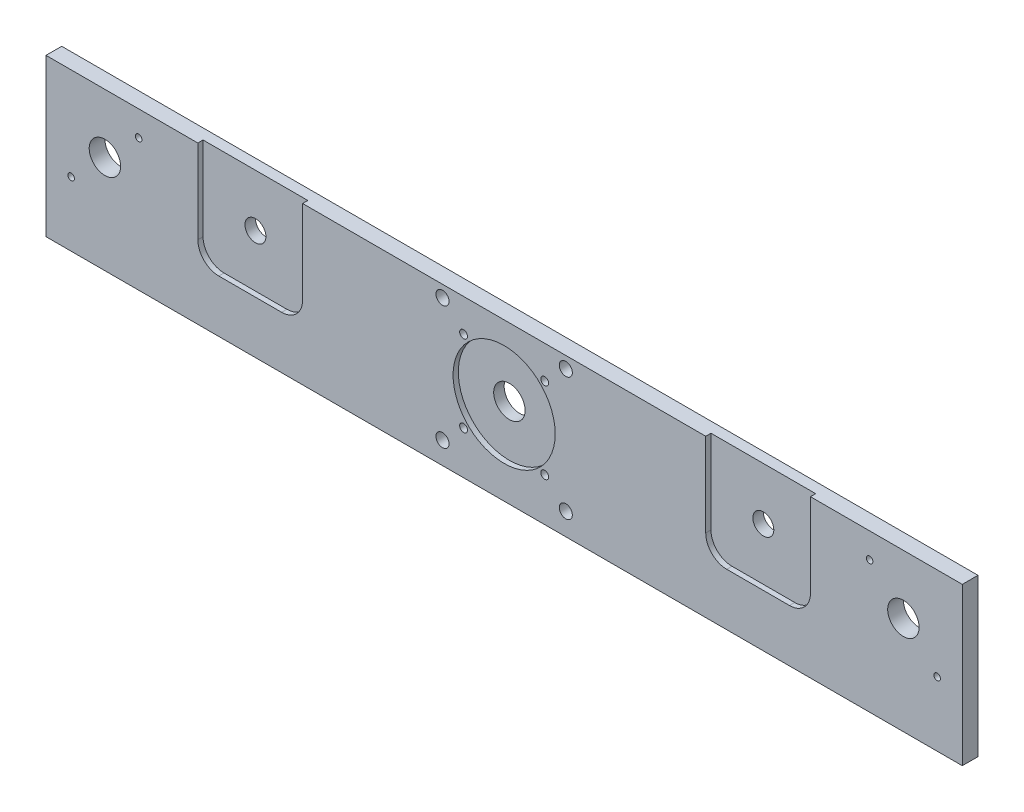
ISO-10303-21;
HEADER;
FILE_DESCRIPTION(('STEP AP214'),'2;1');
FILE_NAME('part.step','',(''),(''),'','','');
FILE_SCHEMA(('AUTOMOTIVE_DESIGN { 1 0 10303 214 1 1 1 1 }'));
ENDSEC;
DATA;
#1=APPLICATION_CONTEXT('core data for automotive mechanical design processes');
#2=APPLICATION_PROTOCOL_DEFINITION('international standard','automotive_design',2000,#1);
#3=PRODUCT_CONTEXT('',#1,'mechanical');
#4=PRODUCT('Part','Part','',(#3));
#5=PRODUCT_RELATED_PRODUCT_CATEGORY('part','',(#4));
#6=PRODUCT_DEFINITION_FORMATION('','',#4);
#7=PRODUCT_DEFINITION_CONTEXT('part definition',#1,'design');
#8=PRODUCT_DEFINITION('design','',#6,#7);
#9=PRODUCT_DEFINITION_SHAPE('','',#8);
#10=(LENGTH_UNIT() NAMED_UNIT(*) SI_UNIT(.MILLI.,.METRE.));
#11=(NAMED_UNIT(*) PLANE_ANGLE_UNIT() SI_UNIT($,.RADIAN.));
#12=(NAMED_UNIT(*) SI_UNIT($,.STERADIAN.) SOLID_ANGLE_UNIT());
#13=UNCERTAINTY_MEASURE_WITH_UNIT(LENGTH_MEASURE(1.E-05),#10,'distance_accuracy_value','');
#14=(GEOMETRIC_REPRESENTATION_CONTEXT(3) GLOBAL_UNCERTAINTY_ASSIGNED_CONTEXT((#13)) GLOBAL_UNIT_ASSIGNED_CONTEXT((#10,
#11,#12)) REPRESENTATION_CONTEXT('',''));
#15=CARTESIAN_POINT('',(0.,0.,0.));
#16=DIRECTION('',(0.,0.,1.));
#17=DIRECTION('',(1.,0.,0.));
#18=AXIS2_PLACEMENT_3D('',#15,#16,#17);
#19=CARTESIAN_POINT('',(-175.,-28.,0.));
#20=DIRECTION('',(0.,0.,1.));
#21=DIRECTION('',(1.,0.,0.));
#22=AXIS2_PLACEMENT_3D('',#19,#20,#21);
#23=CYLINDRICAL_SURFACE('',#22,6.00000000000002);
#24=CARTESIAN_POINT('',(-175.,-28.,0.));
#25=DIRECTION('',(0.,0.,1.));
#26=DIRECTION('',(1.,0.,0.));
#27=AXIS2_PLACEMENT_3D('',#24,#25,#26);
#28=CIRCLE('',#27,6.00000000000002);
#29=CARTESIAN_POINT('',(-169.,-28.,0.));
#30=VERTEX_POINT('',#29);
#31=EDGE_CURVE('E272',#30,#30,#28,.T.);
#32=ORIENTED_EDGE('',*,*,#31,.F.);
#33=EDGE_LOOP('',(#32));
#34=FACE_BOUND('',#33,.T.);
#35=CARTESIAN_POINT('',(-175.,-28.,4.));
#36=DIRECTION('',(0.,0.,1.));
#37=DIRECTION('',(1.,0.,0.));
#38=AXIS2_PLACEMENT_3D('',#35,#36,#37);
#39=CIRCLE('',#38,6.00000000000002);
#40=CARTESIAN_POINT('',(-169.,-28.,4.));
#41=VERTEX_POINT('',#40);
#42=EDGE_CURVE('E39',#41,#41,#39,.F.);
#43=ORIENTED_EDGE('',*,*,#42,.F.);
#44=EDGE_LOOP('',(#43));
#45=FACE_BOUND('',#44,.T.);
#46=ADVANCED_FACE('F35',(#34,#45),#23,.F.);
#47=CARTESIAN_POINT('',(-350.,-60.,6.));
#48=DIRECTION('',(-1.,0.,0.));
#49=DIRECTION('',(0.,0.,1.));
#50=AXIS2_PLACEMENT_3D('',#47,#48,#49);
#51=PLANE('',#50);
#52=DIRECTION('',(0.,1.,0.));
#53=VECTOR('',#52,1.);
#54=CARTESIAN_POINT('',(-350.,-60.,0.));
#55=LINE('',#54,#53);
#56=CARTESIAN_POINT('',(-350.,-60.,0.));
#57=VERTEX_POINT('',#56);
#58=CARTESIAN_POINT('',(-350.,0.,0.));
#59=VERTEX_POINT('',#58);
#60=EDGE_CURVE('E338',#57,#59,#55,.T.);
#61=ORIENTED_EDGE('',*,*,#60,.F.);
#62=DIRECTION('',(0.,0.,-1.));
#63=VECTOR('',#62,1.);
#64=CARTESIAN_POINT('',(-350.,-60.,6.));
#65=LINE('',#64,#63);
#66=CARTESIAN_POINT('',(-350.,-60.,6.));
#67=VERTEX_POINT('',#66);
#68=EDGE_CURVE('E11',#67,#57,#65,.T.);
#69=ORIENTED_EDGE('',*,*,#68,.F.);
#70=DIRECTION('',(0.,1.,0.));
#71=VECTOR('',#70,1.);
#72=CARTESIAN_POINT('',(-350.,-60.,6.));
#73=LINE('',#72,#71);
#74=CARTESIAN_POINT('',(-350.,0.,6.));
#75=VERTEX_POINT('',#74);
#76=EDGE_CURVE('E341',#67,#75,#73,.T.);
#77=ORIENTED_EDGE('',*,*,#76,.T.);
#78=DIRECTION('',(0.,0.,-1.));
#79=VECTOR('',#78,1.);
#80=CARTESIAN_POINT('',(-350.,0.,6.));
#81=LINE('',#80,#79);
#82=EDGE_CURVE('E355',#75,#59,#81,.T.);
#83=ORIENTED_EDGE('',*,*,#82,.T.);
#84=EDGE_LOOP('',(#61,#69,#77,#83));
#85=FACE_BOUND('',#84,.T.);
#86=ADVANCED_FACE('F37',(#85),#51,.T.);
#87=CARTESIAN_POINT('',(-350.,-60.,6.));
#88=DIRECTION('',(0.,1.,0.));
#89=DIRECTION('',(0.,0.,1.));
#90=AXIS2_PLACEMENT_3D('',#87,#88,#89);
#91=PLANE('',#90);
#92=DIRECTION('',(1.,0.,0.));
#93=VECTOR('',#92,1.);
#94=CARTESIAN_POINT('',(-350.,-60.,0.));
#95=LINE('',#94,#93);
#96=CARTESIAN_POINT('',(0.,-60.,0.));
#97=VERTEX_POINT('',#96);
#98=EDGE_CURVE('E345',#57,#97,#95,.T.);
#99=ORIENTED_EDGE('',*,*,#98,.T.);
#100=DIRECTION('',(0.,0.,-1.));
#101=VECTOR('',#100,1.);
#102=CARTESIAN_POINT('',(0.,-60.,6.));
#103=LINE('',#102,#101);
#104=CARTESIAN_POINT('',(0.,-60.,6.));
#105=VERTEX_POINT('',#104);
#106=EDGE_CURVE('E44',#105,#97,#103,.T.);
#107=ORIENTED_EDGE('',*,*,#106,.F.);
#108=DIRECTION('',(1.,0.,0.));
#109=VECTOR('',#108,1.);
#110=CARTESIAN_POINT('',(-350.,-60.,6.));
#111=LINE('',#110,#109);
#112=EDGE_CURVE('E353',#67,#105,#111,.T.);
#113=ORIENTED_EDGE('',*,*,#112,.F.);
#114=ORIENTED_EDGE('',*,*,#68,.T.);
#115=EDGE_LOOP('',(#99,#107,#113,#114));
#116=FACE_BOUND('',#115,.T.);
#117=ADVANCED_FACE('F382',(#116),#91,.F.);
#118=CARTESIAN_POINT('',(0.,-60.,6.));
#119=DIRECTION('',(-1.,0.,0.));
#120=DIRECTION('',(0.,0.,1.));
#121=AXIS2_PLACEMENT_3D('',#118,#119,#120);
#122=PLANE('',#121);
#123=DIRECTION('',(0.,1.,0.));
#124=VECTOR('',#123,1.);
#125=CARTESIAN_POINT('',(0.,-60.,0.));
#126=LINE('',#125,#124);
#127=CARTESIAN_POINT('',(0.,0.,0.));
#128=VERTEX_POINT('',#127);
#129=EDGE_CURVE('E361',#97,#128,#126,.T.);
#130=ORIENTED_EDGE('',*,*,#129,.T.);
#131=DIRECTION('',(0.,0.,-1.));
#132=VECTOR('',#131,1.);
#133=CARTESIAN_POINT('',(0.,0.,6.));
#134=LINE('',#133,#132);
#135=CARTESIAN_POINT('',(0.,0.,6.));
#136=VERTEX_POINT('',#135);
#137=EDGE_CURVE('E367',#136,#128,#134,.T.);
#138=ORIENTED_EDGE('',*,*,#137,.F.);
#139=DIRECTION('',(0.,1.,0.));
#140=VECTOR('',#139,1.);
#141=CARTESIAN_POINT('',(0.,-60.,6.));
#142=LINE('',#141,#140);
#143=EDGE_CURVE('E349',#105,#136,#142,.T.);
#144=ORIENTED_EDGE('',*,*,#143,.F.);
#145=ORIENTED_EDGE('',*,*,#106,.T.);
#146=EDGE_LOOP('',(#130,#138,#144,#145));
#147=FACE_BOUND('',#146,.T.);
#148=ADVANCED_FACE('F386',(#147),#122,.F.);
#149=CARTESIAN_POINT('',(-350.,0.,6.));
#150=DIRECTION('',(0.,1.,0.));
#151=DIRECTION('',(0.,0.,1.));
#152=AXIS2_PLACEMENT_3D('',#149,#150,#151);
#153=PLANE('',#152);
#154=DIRECTION('',(0.,0.,1.));
#155=VECTOR('',#154,1.);
#156=CARTESIAN_POINT('',(-292.,0.,4.));
#157=LINE('',#156,#155);
#158=CARTESIAN_POINT('',(-292.,0.,4.));
#159=VERTEX_POINT('',#158);
#160=CARTESIAN_POINT('',(-292.,0.,6.));
#161=VERTEX_POINT('',#160);
#162=EDGE_CURVE('E194',#159,#161,#157,.T.);
#163=ORIENTED_EDGE('',*,*,#162,.F.);
#164=DIRECTION('',(-1.,0.,0.));
#165=VECTOR('',#164,1.);
#166=CARTESIAN_POINT('',(-292.,0.,4.));
#167=LINE('',#166,#165);
#168=CARTESIAN_POINT('',(-252.,0.,4.));
#169=VERTEX_POINT('',#168);
#170=EDGE_CURVE('E156',#169,#159,#167,.T.);
#171=ORIENTED_EDGE('',*,*,#170,.F.);
#172=DIRECTION('',(0.,0.,1.));
#173=VECTOR('',#172,1.);
#174=CARTESIAN_POINT('',(-252.,0.,4.));
#175=LINE('',#174,#173);
#176=CARTESIAN_POINT('',(-252.,0.,6.));
#177=VERTEX_POINT('',#176);
#178=EDGE_CURVE('E196',#169,#177,#175,.T.);
#179=ORIENTED_EDGE('',*,*,#178,.T.);
#180=DIRECTION('',(1.,0.,0.));
#181=VECTOR('',#180,1.);
#182=CARTESIAN_POINT('',(-350.,0.,6.));
#183=LINE('',#182,#181);
#184=CARTESIAN_POINT('',(-98.,0.,6.));
#185=VERTEX_POINT('',#184);
#186=EDGE_CURVE('E350',#177,#185,#183,.T.);
#187=ORIENTED_EDGE('',*,*,#186,.T.);
#188=DIRECTION('',(0.,0.,1.));
#189=VECTOR('',#188,1.);
#190=CARTESIAN_POINT('',(-98.,0.,4.));
#191=LINE('',#190,#189);
#192=CARTESIAN_POINT('',(-98.,0.,4.));
#193=VERTEX_POINT('',#192);
#194=EDGE_CURVE('E187',#193,#185,#191,.T.);
#195=ORIENTED_EDGE('',*,*,#194,.F.);
#196=DIRECTION('',(-1.,0.,0.));
#197=VECTOR('',#196,1.);
#198=CARTESIAN_POINT('',(-98.,0.,4.));
#199=LINE('',#198,#197);
#200=CARTESIAN_POINT('',(-58.,0.,4.));
#201=VERTEX_POINT('',#200);
#202=EDGE_CURVE('E220',#201,#193,#199,.T.);
#203=ORIENTED_EDGE('',*,*,#202,.F.);
#204=DIRECTION('',(0.,0.,1.));
#205=VECTOR('',#204,1.);
#206=CARTESIAN_POINT('',(-58.,0.,4.));
#207=LINE('',#206,#205);
#208=CARTESIAN_POINT('',(-58.,0.,6.));
#209=VERTEX_POINT('',#208);
#210=EDGE_CURVE('E237',#201,#209,#207,.T.);
#211=ORIENTED_EDGE('',*,*,#210,.T.);
#212=EDGE_CURVE('E344',#209,#136,#183,.T.);
#213=ORIENTED_EDGE('',*,*,#212,.T.);
#214=ORIENTED_EDGE('',*,*,#137,.T.);
#215=DIRECTION('',(1.,0.,0.));
#216=VECTOR('',#215,1.);
#217=CARTESIAN_POINT('',(-350.,0.,0.));
#218=LINE('',#217,#216);
#219=EDGE_CURVE('E358',#59,#128,#218,.T.);
#220=ORIENTED_EDGE('',*,*,#219,.F.);
#221=ORIENTED_EDGE('',*,*,#82,.F.);
#222=EDGE_CURVE('E346',#75,#161,#183,.T.);
#223=ORIENTED_EDGE('',*,*,#222,.T.);
#224=EDGE_LOOP('',(#163,#171,#179,#187,#195,#203,#211,#213,#214,#220,#221,#223));
#225=FACE_BOUND('',#224,.T.);
#226=ADVANCED_FACE('F374',(#225),#153,.T.);
#227=CARTESIAN_POINT('',(0.,0.,6.));
#228=DIRECTION('',(0.,0.,-1.));
#229=DIRECTION('',(-1.,0.,0.));
#230=AXIS2_PLACEMENT_3D('',#227,#228,#229);
#231=PLANE('',#230);
#232=CARTESIAN_POINT('',(-175.,-28.,6.));
#233=DIRECTION('',(0.,0.,1.));
#234=DIRECTION('',(1.,0.,0.));
#235=AXIS2_PLACEMENT_3D('',#232,#233,#234);
#236=CIRCLE('',#235,19.5);
#237=CARTESIAN_POINT('',(-155.5,-28.,6.));
#238=VERTEX_POINT('',#237);
#239=EDGE_CURVE('E249',#238,#238,#236,.T.);
#240=ORIENTED_EDGE('',*,*,#239,.F.);
#241=EDGE_LOOP('',(#240));
#242=FACE_BOUND('',#241,.T.);
#243=CARTESIAN_POINT('',(-151.45,-4.45000000000003,6.));
#244=DIRECTION('',(0.,0.,1.));
#245=DIRECTION('',(1.,0.,0.));
#246=AXIS2_PLACEMENT_3D('',#243,#244,#245);
#247=CIRCLE('',#246,2.5);
#248=CARTESIAN_POINT('',(-148.95,-4.45000000000003,6.));
#249=VERTEX_POINT('',#248);
#250=EDGE_CURVE('E256',#249,#249,#247,.T.);
#251=ORIENTED_EDGE('',*,*,#250,.F.);
#252=EDGE_LOOP('',(#251));
#253=FACE_BOUND('',#252,.T.);
#254=CARTESIAN_POINT('',(-159.5,-12.5,6.));
#255=DIRECTION('',(0.,0.,1.));
#256=DIRECTION('',(1.,0.,0.));
#257=AXIS2_PLACEMENT_3D('',#254,#255,#256);
#258=CIRCLE('',#257,1.5);
#259=CARTESIAN_POINT('',(-158.,-12.5,6.));
#260=VERTEX_POINT('',#259);
#261=EDGE_CURVE('E279',#260,#260,#258,.T.);
#262=ORIENTED_EDGE('',*,*,#261,.F.);
#263=EDGE_LOOP('',(#262));
#264=FACE_BOUND('',#263,.T.);
#265=CARTESIAN_POINT('',(-159.5,-43.5,6.));
#266=DIRECTION('',(0.,0.,1.));
#267=DIRECTION('',(1.,0.,0.));
#268=AXIS2_PLACEMENT_3D('',#265,#266,#267);
#269=CIRCLE('',#268,1.5);
#270=CARTESIAN_POINT('',(-158.,-43.5,6.));
#271=VERTEX_POINT('',#270);
#272=EDGE_CURVE('E278',#271,#271,#269,.T.);
#273=ORIENTED_EDGE('',*,*,#272,.F.);
#274=EDGE_LOOP('',(#273));
#275=FACE_BOUND('',#274,.T.);
#276=CARTESIAN_POINT('',(-190.5,-12.5,6.));
#277=DIRECTION('',(0.,0.,1.));
#278=DIRECTION('',(1.,0.,0.));
#279=AXIS2_PLACEMENT_3D('',#276,#277,#278);
#280=CIRCLE('',#279,1.5);
#281=CARTESIAN_POINT('',(-189.,-12.5,6.));
#282=VERTEX_POINT('',#281);
#283=EDGE_CURVE('E291',#282,#282,#280,.T.);
#284=ORIENTED_EDGE('',*,*,#283,.F.);
#285=EDGE_LOOP('',(#284));
#286=FACE_BOUND('',#285,.T.);
#287=CARTESIAN_POINT('',(-190.5,-43.5,6.));
#288=DIRECTION('',(0.,0.,1.));
#289=DIRECTION('',(1.,0.,0.));
#290=AXIS2_PLACEMENT_3D('',#287,#288,#289);
#291=CIRCLE('',#290,1.5);
#292=CARTESIAN_POINT('',(-189.,-43.5,6.));
#293=VERTEX_POINT('',#292);
#294=EDGE_CURVE('E257',#293,#293,#291,.T.);
#295=ORIENTED_EDGE('',*,*,#294,.F.);
#296=EDGE_LOOP('',(#295));
#297=FACE_BOUND('',#296,.T.);
#298=CARTESIAN_POINT('',(-198.55,-4.45000000000003,6.));
#299=DIRECTION('',(0.,0.,1.));
#300=DIRECTION('',(1.,0.,0.));
#301=AXIS2_PLACEMENT_3D('',#298,#299,#300);
#302=CIRCLE('',#301,2.5);
#303=CARTESIAN_POINT('',(-196.05,-4.45000000000003,6.));
#304=VERTEX_POINT('',#303);
#305=EDGE_CURVE('E263',#304,#304,#302,.T.);
#306=ORIENTED_EDGE('',*,*,#305,.F.);
#307=EDGE_LOOP('',(#306));
#308=FACE_BOUND('',#307,.T.);
#309=CARTESIAN_POINT('',(-151.45,-51.55,6.));
#310=DIRECTION('',(0.,0.,1.));
#311=DIRECTION('',(1.,0.,0.));
#312=AXIS2_PLACEMENT_3D('',#309,#310,#311);
#313=CIRCLE('',#312,2.5);
#314=CARTESIAN_POINT('',(-148.95,-51.55,6.));
#315=VERTEX_POINT('',#314);
#316=EDGE_CURVE('E269',#315,#315,#313,.T.);
#317=ORIENTED_EDGE('',*,*,#316,.F.);
#318=EDGE_LOOP('',(#317));
#319=FACE_BOUND('',#318,.T.);
#320=CARTESIAN_POINT('',(-198.55,-51.55,6.));
#321=DIRECTION('',(0.,0.,1.));
#322=DIRECTION('',(1.,0.,0.));
#323=AXIS2_PLACEMENT_3D('',#320,#321,#322);
#324=CIRCLE('',#323,2.5);
#325=CARTESIAN_POINT('',(-196.05,-51.55,6.));
#326=VERTEX_POINT('',#325);
#327=EDGE_CURVE('E290',#326,#326,#324,.T.);
#328=ORIENTED_EDGE('',*,*,#327,.F.);
#329=EDGE_LOOP('',(#328));
#330=FACE_BOUND('',#329,.T.);
#331=CARTESIAN_POINT('',(-9.59530124334555,-35.4046987566545,6.));
#332=DIRECTION('',(0.,0.,1.));
#333=DIRECTION('',(1.,0.,0.));
#334=AXIS2_PLACEMENT_3D('',#331,#332,#333);
#335=CIRCLE('',#334,1.25);
#336=CARTESIAN_POINT('',(-8.34530124334555,-35.4046987566545,6.));
#337=VERTEX_POINT('',#336);
#338=EDGE_CURVE('E302',#337,#337,#335,.T.);
#339=ORIENTED_EDGE('',*,*,#338,.F.);
#340=EDGE_LOOP('',(#339));
#341=FACE_BOUND('',#340,.T.);
#342=CARTESIAN_POINT('',(-35.4046987566545,-9.59530124334548,6.));
#343=DIRECTION('',(0.,0.,1.));
#344=DIRECTION('',(1.,0.,0.));
#345=AXIS2_PLACEMENT_3D('',#342,#343,#344);
#346=CIRCLE('',#345,1.25000000000001);
#347=CARTESIAN_POINT('',(-34.1546987566545,-9.59530124334548,6.));
#348=VERTEX_POINT('',#347);
#349=EDGE_CURVE('E327',#348,#348,#346,.T.);
#350=ORIENTED_EDGE('',*,*,#349,.F.);
#351=EDGE_LOOP('',(#350));
#352=FACE_BOUND('',#351,.T.);
#353=CARTESIAN_POINT('',(-314.595301243346,-9.59530124334546,6.));
#354=DIRECTION('',(0.,0.,1.));
#355=DIRECTION('',(1.,0.,0.));
#356=AXIS2_PLACEMENT_3D('',#353,#354,#355);
#357=CIRCLE('',#356,1.24999999999996);
#358=CARTESIAN_POINT('',(-313.345301243346,-9.59530124334546,6.));
#359=VERTEX_POINT('',#358);
#360=EDGE_CURVE('E321',#359,#359,#357,.T.);
#361=ORIENTED_EDGE('',*,*,#360,.F.);
#362=EDGE_LOOP('',(#361));
#363=FACE_BOUND('',#362,.T.);
#364=CARTESIAN_POINT('',(-340.404698756654,-35.4046987566545,6.));
#365=DIRECTION('',(0.,0.,1.));
#366=DIRECTION('',(1.,0.,0.));
#367=AXIS2_PLACEMENT_3D('',#364,#365,#366);
#368=CIRCLE('',#367,1.2499999999999);
#369=CARTESIAN_POINT('',(-339.154698756655,-35.4046987566545,6.));
#370=VERTEX_POINT('',#369);
#371=EDGE_CURVE('E315',#370,#370,#368,.T.);
#372=ORIENTED_EDGE('',*,*,#371,.F.);
#373=EDGE_LOOP('',(#372));
#374=FACE_BOUND('',#373,.T.);
#375=CARTESIAN_POINT('',(-22.5,-22.5,6.));
#376=DIRECTION('',(0.,0.,1.));
#377=DIRECTION('',(1.,0.,0.));
#378=AXIS2_PLACEMENT_3D('',#375,#376,#377);
#379=CIRCLE('',#378,6.);
#380=CARTESIAN_POINT('',(-16.5,-22.5,6.));
#381=VERTEX_POINT('',#380);
#382=EDGE_CURVE('E309',#381,#381,#379,.T.);
#383=ORIENTED_EDGE('',*,*,#382,.F.);
#384=EDGE_LOOP('',(#383));
#385=FACE_BOUND('',#384,.T.);
#386=CARTESIAN_POINT('',(-327.5,-22.5,6.));
#387=DIRECTION('',(0.,0.,1.));
#388=DIRECTION('',(1.,0.,0.));
#389=AXIS2_PLACEMENT_3D('',#386,#387,#388);
#390=CIRCLE('',#389,5.99999999999999);
#391=CARTESIAN_POINT('',(-321.5,-22.5,6.));
#392=VERTEX_POINT('',#391);
#393=EDGE_CURVE('E308',#392,#392,#390,.T.);
#394=ORIENTED_EDGE('',*,*,#393,.F.);
#395=EDGE_LOOP('',(#394));
#396=FACE_BOUND('',#395,.T.);
#397=CARTESIAN_POINT('',(-284.,-32.,6.));
#398=DIRECTION('',(0.,0.,1.));
#399=DIRECTION('',(-1.,0.,0.));
#400=AXIS2_PLACEMENT_3D('',#397,#398,#399);
#401=CIRCLE('',#400,8.);
#402=CARTESIAN_POINT('',(-292.,-32.,6.));
#403=VERTEX_POINT('',#402);
#404=CARTESIAN_POINT('',(-284.,-40.,6.));
#405=VERTEX_POINT('',#404);
#406=EDGE_CURVE('E186',#403,#405,#401,.T.);
#407=ORIENTED_EDGE('',*,*,#406,.F.);
#408=DIRECTION('',(0.,-1.,0.));
#409=VECTOR('',#408,1.);
#410=CARTESIAN_POINT('',(-292.,0.,6.));
#411=LINE('',#410,#409);
#412=EDGE_CURVE('E52',#161,#403,#411,.T.);
#413=ORIENTED_EDGE('',*,*,#412,.F.);
#414=ORIENTED_EDGE('',*,*,#222,.F.);
#415=ORIENTED_EDGE('',*,*,#76,.F.);
#416=ORIENTED_EDGE('',*,*,#112,.T.);
#417=ORIENTED_EDGE('',*,*,#143,.T.);
#418=ORIENTED_EDGE('',*,*,#212,.F.);
#419=DIRECTION('',(0.,1.,0.));
#420=VECTOR('',#419,1.);
#421=CARTESIAN_POINT('',(-58.,0.,6.));
#422=LINE('',#421,#420);
#423=CARTESIAN_POINT('',(-58.,-32.,6.));
#424=VERTEX_POINT('',#423);
#425=EDGE_CURVE('E208',#424,#209,#422,.T.);
#426=ORIENTED_EDGE('',*,*,#425,.F.);
#427=CARTESIAN_POINT('',(-66.,-32.,6.));
#428=DIRECTION('',(0.,0.,1.));
#429=DIRECTION('',(1.,0.,0.));
#430=AXIS2_PLACEMENT_3D('',#427,#428,#429);
#431=CIRCLE('',#430,8.);
#432=CARTESIAN_POINT('',(-66.,-40.,6.));
#433=VERTEX_POINT('',#432);
#434=EDGE_CURVE('E232',#433,#424,#431,.T.);
#435=ORIENTED_EDGE('',*,*,#434,.F.);
#436=DIRECTION('',(1.,0.,0.));
#437=VECTOR('',#436,1.);
#438=CARTESIAN_POINT('',(-90.,-40.,6.));
#439=LINE('',#438,#437);
#440=CARTESIAN_POINT('',(-90.,-40.,6.));
#441=VERTEX_POINT('',#440);
#442=EDGE_CURVE('E229',#441,#433,#439,.T.);
#443=ORIENTED_EDGE('',*,*,#442,.F.);
#444=CARTESIAN_POINT('',(-90.,-32.,6.));
#445=DIRECTION('',(0.,0.,1.));
#446=DIRECTION('',(-1.,0.,0.));
#447=AXIS2_PLACEMENT_3D('',#444,#445,#446);
#448=CIRCLE('',#447,8.);
#449=CARTESIAN_POINT('',(-98.,-32.,6.));
#450=VERTEX_POINT('',#449);
#451=EDGE_CURVE('E225',#450,#441,#448,.T.);
#452=ORIENTED_EDGE('',*,*,#451,.F.);
#453=DIRECTION('',(0.,-1.,0.));
#454=VECTOR('',#453,1.);
#455=CARTESIAN_POINT('',(-98.,0.,6.));
#456=LINE('',#455,#454);
#457=EDGE_CURVE('E60',#185,#450,#456,.T.);
#458=ORIENTED_EDGE('',*,*,#457,.F.);
#459=ORIENTED_EDGE('',*,*,#186,.F.);
#460=DIRECTION('',(0.,1.,0.));
#461=VECTOR('',#460,1.);
#462=CARTESIAN_POINT('',(-252.,0.,6.));
#463=LINE('',#462,#461);
#464=CARTESIAN_POINT('',(-252.,-31.9999999999999,6.));
#465=VERTEX_POINT('',#464);
#466=EDGE_CURVE('E170',#465,#177,#463,.T.);
#467=ORIENTED_EDGE('',*,*,#466,.F.);
#468=CARTESIAN_POINT('',(-260.,-32.,6.));
#469=DIRECTION('',(0.,0.,1.));
#470=DIRECTION('',(1.,0.,0.));
#471=AXIS2_PLACEMENT_3D('',#468,#469,#470);
#472=CIRCLE('',#471,8.);
#473=CARTESIAN_POINT('',(-260.,-40.,6.));
#474=VERTEX_POINT('',#473);
#475=EDGE_CURVE('E172',#474,#465,#472,.T.);
#476=ORIENTED_EDGE('',*,*,#475,.F.);
#477=DIRECTION('',(1.,0.,0.));
#478=VECTOR('',#477,1.);
#479=CARTESIAN_POINT('',(-284.,-40.,6.));
#480=LINE('',#479,#478);
#481=EDGE_CURVE('E189',#405,#474,#480,.T.);
#482=ORIENTED_EDGE('',*,*,#481,.F.);
#483=EDGE_LOOP('',(#407,#413,#414,#415,#416,#417,#418,#426,#435,#443,#452,#458,#459,#467,#476,#482));
#484=FACE_BOUND('',#483,.T.);
#485=ADVANCED_FACE('F389',(#242,#253,#264,#275,#286,#297,#308,#319,#330,#341,#352,#363,#374,
#385,#396,#484),#231,.F.);
#486=CARTESIAN_POINT('',(0.,0.,0.));
#487=DIRECTION('',(0.,0.,-1.));
#488=DIRECTION('',(-1.,0.,0.));
#489=AXIS2_PLACEMENT_3D('',#486,#487,#488);
#490=PLANE('',#489);
#491=CARTESIAN_POINT('',(-272.,-20.,0.));
#492=DIRECTION('',(0.,0.,1.));
#493=DIRECTION('',(1.,0.,0.));
#494=AXIS2_PLACEMENT_3D('',#491,#492,#493);
#495=CIRCLE('',#494,3.99999999999999);
#496=CARTESIAN_POINT('',(-268.,-20.,0.));
#497=VERTEX_POINT('',#496);
#498=EDGE_CURVE('E252',#497,#497,#495,.T.);
#499=ORIENTED_EDGE('',*,*,#498,.T.);
#500=EDGE_LOOP('',(#499));
#501=FACE_BOUND('',#500,.T.);
#502=CARTESIAN_POINT('',(-78.,-20.,0.));
#503=DIRECTION('',(0.,0.,1.));
#504=DIRECTION('',(1.,0.,0.));
#505=AXIS2_PLACEMENT_3D('',#502,#503,#504);
#506=CIRCLE('',#505,3.99999999999999);
#507=CARTESIAN_POINT('',(-74.,-20.,0.));
#508=VERTEX_POINT('',#507);
#509=EDGE_CURVE('E704',#508,#508,#506,.T.);
#510=ORIENTED_EDGE('',*,*,#509,.T.);
#511=EDGE_LOOP('',(#510));
#512=FACE_BOUND('',#511,.T.);
#513=CARTESIAN_POINT('',(-151.45,-4.45000000000003,0.));
#514=DIRECTION('',(0.,0.,1.));
#515=DIRECTION('',(1.,0.,0.));
#516=AXIS2_PLACEMENT_3D('',#513,#514,#515);
#517=CIRCLE('',#516,2.5);
#518=CARTESIAN_POINT('',(-148.95,-4.45000000000003,0.));
#519=VERTEX_POINT('',#518);
#520=EDGE_CURVE('E282',#519,#519,#517,.T.);
#521=ORIENTED_EDGE('',*,*,#520,.T.);
#522=EDGE_LOOP('',(#521));
#523=FACE_BOUND('',#522,.T.);
#524=CARTESIAN_POINT('',(-159.5,-12.5,0.));
#525=DIRECTION('',(0.,0.,1.));
#526=DIRECTION('',(1.,0.,0.));
#527=AXIS2_PLACEMENT_3D('',#524,#525,#526);
#528=CIRCLE('',#527,1.5);
#529=CARTESIAN_POINT('',(-158.,-12.5,0.));
#530=VERTEX_POINT('',#529);
#531=EDGE_CURVE('E275',#530,#530,#528,.T.);
#532=ORIENTED_EDGE('',*,*,#531,.T.);
#533=EDGE_LOOP('',(#532));
#534=FACE_BOUND('',#533,.T.);
#535=CARTESIAN_POINT('',(-159.5,-43.5,0.));
#536=DIRECTION('',(0.,0.,1.));
#537=DIRECTION('',(1.,0.,0.));
#538=AXIS2_PLACEMENT_3D('',#535,#536,#537);
#539=CIRCLE('',#538,1.5);
#540=CARTESIAN_POINT('',(-158.,-43.5,0.));
#541=VERTEX_POINT('',#540);
#542=EDGE_CURVE('E294',#541,#541,#539,.T.);
#543=ORIENTED_EDGE('',*,*,#542,.T.);
#544=EDGE_LOOP('',(#543));
#545=FACE_BOUND('',#544,.T.);
#546=CARTESIAN_POINT('',(-190.5,-12.5,0.));
#547=DIRECTION('',(0.,0.,1.));
#548=DIRECTION('',(1.,0.,0.));
#549=AXIS2_PLACEMENT_3D('',#546,#547,#548);
#550=CIRCLE('',#549,1.5);
#551=CARTESIAN_POINT('',(-189.,-12.5,0.));
#552=VERTEX_POINT('',#551);
#553=EDGE_CURVE('E287',#552,#552,#550,.T.);
#554=ORIENTED_EDGE('',*,*,#553,.T.);
#555=EDGE_LOOP('',(#554));
#556=FACE_BOUND('',#555,.T.);
#557=CARTESIAN_POINT('',(-190.5,-43.5,0.));
#558=DIRECTION('',(0.,0.,1.));
#559=DIRECTION('',(1.,0.,0.));
#560=AXIS2_PLACEMENT_3D('',#557,#558,#559);
#561=CIRCLE('',#560,1.5);
#562=CARTESIAN_POINT('',(-189.,-43.5,0.));
#563=VERTEX_POINT('',#562);
#564=EDGE_CURVE('E253',#563,#563,#561,.T.);
#565=ORIENTED_EDGE('',*,*,#564,.T.);
#566=EDGE_LOOP('',(#565));
#567=FACE_BOUND('',#566,.T.);
#568=CARTESIAN_POINT('',(-198.55,-4.45000000000003,0.));
#569=DIRECTION('',(0.,0.,1.));
#570=DIRECTION('',(1.,0.,0.));
#571=AXIS2_PLACEMENT_3D('',#568,#569,#570);
#572=CIRCLE('',#571,2.5);
#573=CARTESIAN_POINT('',(-196.05,-4.45000000000003,0.));
#574=VERTEX_POINT('',#573);
#575=EDGE_CURVE('E260',#574,#574,#572,.T.);
#576=ORIENTED_EDGE('',*,*,#575,.T.);
#577=EDGE_LOOP('',(#576));
#578=FACE_BOUND('',#577,.T.);
#579=CARTESIAN_POINT('',(-151.45,-51.55,0.));
#580=DIRECTION('',(0.,0.,1.));
#581=DIRECTION('',(1.,0.,0.));
#582=AXIS2_PLACEMENT_3D('',#579,#580,#581);
#583=CIRCLE('',#582,2.5);
#584=CARTESIAN_POINT('',(-148.95,-51.55,0.));
#585=VERTEX_POINT('',#584);
#586=EDGE_CURVE('E266',#585,#585,#583,.T.);
#587=ORIENTED_EDGE('',*,*,#586,.T.);
#588=EDGE_LOOP('',(#587));
#589=FACE_BOUND('',#588,.T.);
#590=ORIENTED_EDGE('',*,*,#31,.T.);
#591=EDGE_LOOP('',(#590));
#592=FACE_BOUND('',#591,.T.);
#593=CARTESIAN_POINT('',(-198.55,-51.55,0.));
#594=DIRECTION('',(0.,0.,1.));
#595=DIRECTION('',(1.,0.,0.));
#596=AXIS2_PLACEMENT_3D('',#593,#594,#595);
#597=CIRCLE('',#596,2.5);
#598=CARTESIAN_POINT('',(-196.05,-51.55,0.));
#599=VERTEX_POINT('',#598);
#600=EDGE_CURVE('E299',#599,#599,#597,.T.);
#601=ORIENTED_EDGE('',*,*,#600,.T.);
#602=EDGE_LOOP('',(#601));
#603=FACE_BOUND('',#602,.T.);
#604=CARTESIAN_POINT('',(-9.59530124334555,-35.4046987566545,0.));
#605=DIRECTION('',(0.,0.,1.));
#606=DIRECTION('',(1.,0.,0.));
#607=AXIS2_PLACEMENT_3D('',#604,#605,#606);
#608=CIRCLE('',#607,1.25);
#609=CARTESIAN_POINT('',(-8.34530124334555,-35.4046987566545,0.));
#610=VERTEX_POINT('',#609);
#611=EDGE_CURVE('E330',#610,#610,#608,.T.);
#612=ORIENTED_EDGE('',*,*,#611,.T.);
#613=EDGE_LOOP('',(#612));
#614=FACE_BOUND('',#613,.T.);
#615=CARTESIAN_POINT('',(-35.4046987566545,-9.59530124334548,0.));
#616=DIRECTION('',(0.,0.,1.));
#617=DIRECTION('',(1.,0.,0.));
#618=AXIS2_PLACEMENT_3D('',#615,#616,#617);
#619=CIRCLE('',#618,1.25000000000001);
#620=CARTESIAN_POINT('',(-34.1546987566545,-9.59530124334548,0.));
#621=VERTEX_POINT('',#620);
#622=EDGE_CURVE('E324',#621,#621,#619,.T.);
#623=ORIENTED_EDGE('',*,*,#622,.T.);
#624=EDGE_LOOP('',(#623));
#625=FACE_BOUND('',#624,.T.);
#626=CARTESIAN_POINT('',(-314.595301243346,-9.59530124334546,0.));
#627=DIRECTION('',(0.,0.,1.));
#628=DIRECTION('',(1.,0.,0.));
#629=AXIS2_PLACEMENT_3D('',#626,#627,#628);
#630=CIRCLE('',#629,1.24999999999996);
#631=CARTESIAN_POINT('',(-313.345301243346,-9.59530124334546,0.));
#632=VERTEX_POINT('',#631);
#633=EDGE_CURVE('E318',#632,#632,#630,.T.);
#634=ORIENTED_EDGE('',*,*,#633,.T.);
#635=EDGE_LOOP('',(#634));
#636=FACE_BOUND('',#635,.T.);
#637=CARTESIAN_POINT('',(-340.404698756654,-35.4046987566545,0.));
#638=DIRECTION('',(0.,0.,1.));
#639=DIRECTION('',(1.,0.,0.));
#640=AXIS2_PLACEMENT_3D('',#637,#638,#639);
#641=CIRCLE('',#640,1.2499999999999);
#642=CARTESIAN_POINT('',(-339.154698756655,-35.4046987566545,0.));
#643=VERTEX_POINT('',#642);
#644=EDGE_CURVE('E312',#643,#643,#641,.T.);
#645=ORIENTED_EDGE('',*,*,#644,.T.);
#646=EDGE_LOOP('',(#645));
#647=FACE_BOUND('',#646,.T.);
#648=CARTESIAN_POINT('',(-22.5,-22.5,0.));
#649=DIRECTION('',(0.,0.,1.));
#650=DIRECTION('',(1.,0.,0.));
#651=AXIS2_PLACEMENT_3D('',#648,#649,#650);
#652=CIRCLE('',#651,6.);
#653=CARTESIAN_POINT('',(-16.5,-22.5,0.));
#654=VERTEX_POINT('',#653);
#655=EDGE_CURVE('E305',#654,#654,#652,.T.);
#656=ORIENTED_EDGE('',*,*,#655,.T.);
#657=EDGE_LOOP('',(#656));
#658=FACE_BOUND('',#657,.T.);
#659=CARTESIAN_POINT('',(-327.5,-22.5,0.));
#660=DIRECTION('',(0.,0.,1.));
#661=DIRECTION('',(1.,0.,0.));
#662=AXIS2_PLACEMENT_3D('',#659,#660,#661);
#663=CIRCLE('',#662,5.99999999999999);
#664=CARTESIAN_POINT('',(-321.5,-22.5,0.));
#665=VERTEX_POINT('',#664);
#666=EDGE_CURVE('E335',#665,#665,#663,.T.);
#667=ORIENTED_EDGE('',*,*,#666,.T.);
#668=EDGE_LOOP('',(#667));
#669=FACE_BOUND('',#668,.T.);
#670=ORIENTED_EDGE('',*,*,#60,.T.);
#671=ORIENTED_EDGE('',*,*,#219,.T.);
#672=ORIENTED_EDGE('',*,*,#129,.F.);
#673=ORIENTED_EDGE('',*,*,#98,.F.);
#674=EDGE_LOOP('',(#670,#671,#672,#673));
#675=FACE_BOUND('',#674,.T.);
#676=ADVANCED_FACE('F379',(#501,#512,#523,#534,#545,#556,#567,#578,#589,#592,#603,#614,#625,
#636,#647,#658,#669,#675),#490,.T.);
#677=CARTESIAN_POINT('',(-327.5,-22.5,0.));
#678=DIRECTION('',(0.,0.,1.));
#679=DIRECTION('',(1.,0.,0.));
#680=AXIS2_PLACEMENT_3D('',#677,#678,#679);
#681=CYLINDRICAL_SURFACE('',#680,5.99999999999999);
#682=ORIENTED_EDGE('',*,*,#666,.F.);
#683=EDGE_LOOP('',(#682));
#684=FACE_BOUND('',#683,.T.);
#685=ORIENTED_EDGE('',*,*,#393,.T.);
#686=EDGE_LOOP('',(#685));
#687=FACE_BOUND('',#686,.T.);
#688=ADVANCED_FACE('F468',(#684,#687),#681,.F.);
#689=CARTESIAN_POINT('',(-22.5,-22.5,0.));
#690=DIRECTION('',(0.,0.,1.));
#691=DIRECTION('',(1.,0.,0.));
#692=AXIS2_PLACEMENT_3D('',#689,#690,#691);
#693=CYLINDRICAL_SURFACE('',#692,6.);
#694=ORIENTED_EDGE('',*,*,#655,.F.);
#695=EDGE_LOOP('',(#694));
#696=FACE_BOUND('',#695,.T.);
#697=ORIENTED_EDGE('',*,*,#382,.T.);
#698=EDGE_LOOP('',(#697));
#699=FACE_BOUND('',#698,.T.);
#700=ADVANCED_FACE('F464',(#696,#699),#693,.F.);
#701=CARTESIAN_POINT('',(-340.404698756654,-35.4046987566545,0.));
#702=DIRECTION('',(0.,0.,1.));
#703=DIRECTION('',(1.,0.,0.));
#704=AXIS2_PLACEMENT_3D('',#701,#702,#703);
#705=CYLINDRICAL_SURFACE('',#704,1.2499999999999);
#706=ORIENTED_EDGE('',*,*,#644,.F.);
#707=EDGE_LOOP('',(#706));
#708=FACE_BOUND('',#707,.T.);
#709=ORIENTED_EDGE('',*,*,#371,.T.);
#710=EDGE_LOOP('',(#709));
#711=FACE_BOUND('',#710,.T.);
#712=ADVANCED_FACE('F467',(#708,#711),#705,.F.);
#713=CARTESIAN_POINT('',(-314.595301243346,-9.59530124334546,0.));
#714=DIRECTION('',(0.,0.,1.));
#715=DIRECTION('',(1.,0.,0.));
#716=AXIS2_PLACEMENT_3D('',#713,#714,#715);
#717=CYLINDRICAL_SURFACE('',#716,1.24999999999996);
#718=ORIENTED_EDGE('',*,*,#633,.F.);
#719=EDGE_LOOP('',(#718));
#720=FACE_BOUND('',#719,.T.);
#721=ORIENTED_EDGE('',*,*,#360,.T.);
#722=EDGE_LOOP('',(#721));
#723=FACE_BOUND('',#722,.T.);
#724=ADVANCED_FACE('F472',(#720,#723),#717,.F.);
#725=CARTESIAN_POINT('',(-35.4046987566545,-9.59530124334548,0.));
#726=DIRECTION('',(0.,0.,1.));
#727=DIRECTION('',(1.,0.,0.));
#728=AXIS2_PLACEMENT_3D('',#725,#726,#727);
#729=CYLINDRICAL_SURFACE('',#728,1.25000000000001);
#730=ORIENTED_EDGE('',*,*,#622,.F.);
#731=EDGE_LOOP('',(#730));
#732=FACE_BOUND('',#731,.T.);
#733=ORIENTED_EDGE('',*,*,#349,.T.);
#734=EDGE_LOOP('',(#733));
#735=FACE_BOUND('',#734,.T.);
#736=ADVANCED_FACE('F476',(#732,#735),#729,.F.);
#737=CARTESIAN_POINT('',(-9.59530124334555,-35.4046987566545,0.));
#738=DIRECTION('',(0.,0.,1.));
#739=DIRECTION('',(1.,0.,0.));
#740=AXIS2_PLACEMENT_3D('',#737,#738,#739);
#741=CYLINDRICAL_SURFACE('',#740,1.25);
#742=ORIENTED_EDGE('',*,*,#611,.F.);
#743=EDGE_LOOP('',(#742));
#744=FACE_BOUND('',#743,.T.);
#745=ORIENTED_EDGE('',*,*,#338,.T.);
#746=EDGE_LOOP('',(#745));
#747=FACE_BOUND('',#746,.T.);
#748=ADVANCED_FACE('F462',(#744,#747),#741,.F.);
#749=CARTESIAN_POINT('',(-198.55,-51.55,0.));
#750=DIRECTION('',(0.,0.,1.));
#751=DIRECTION('',(1.,0.,0.));
#752=AXIS2_PLACEMENT_3D('',#749,#750,#751);
#753=CYLINDRICAL_SURFACE('',#752,2.5);
#754=ORIENTED_EDGE('',*,*,#600,.F.);
#755=EDGE_LOOP('',(#754));
#756=FACE_BOUND('',#755,.T.);
#757=ORIENTED_EDGE('',*,*,#327,.T.);
#758=EDGE_LOOP('',(#757));
#759=FACE_BOUND('',#758,.T.);
#760=ADVANCED_FACE('F459',(#756,#759),#753,.F.);
#761=CARTESIAN_POINT('',(-151.45,-51.55,0.));
#762=DIRECTION('',(0.,0.,1.));
#763=DIRECTION('',(1.,0.,0.));
#764=AXIS2_PLACEMENT_3D('',#761,#762,#763);
#765=CYLINDRICAL_SURFACE('',#764,2.5);
#766=ORIENTED_EDGE('',*,*,#586,.F.);
#767=EDGE_LOOP('',(#766));
#768=FACE_BOUND('',#767,.T.);
#769=ORIENTED_EDGE('',*,*,#316,.T.);
#770=EDGE_LOOP('',(#769));
#771=FACE_BOUND('',#770,.T.);
#772=ADVANCED_FACE('F440',(#768,#771),#765,.F.);
#773=CARTESIAN_POINT('',(-198.55,-4.45000000000003,0.));
#774=DIRECTION('',(0.,0.,1.));
#775=DIRECTION('',(1.,0.,0.));
#776=AXIS2_PLACEMENT_3D('',#773,#774,#775);
#777=CYLINDRICAL_SURFACE('',#776,2.5);
#778=ORIENTED_EDGE('',*,*,#575,.F.);
#779=EDGE_LOOP('',(#778));
#780=FACE_BOUND('',#779,.T.);
#781=ORIENTED_EDGE('',*,*,#305,.T.);
#782=EDGE_LOOP('',(#781));
#783=FACE_BOUND('',#782,.T.);
#784=ADVANCED_FACE('F546',(#780,#783),#777,.F.);
#785=CARTESIAN_POINT('',(-190.5,-43.5,0.));
#786=DIRECTION('',(0.,0.,1.));
#787=DIRECTION('',(1.,0.,0.));
#788=AXIS2_PLACEMENT_3D('',#785,#786,#787);
#789=CYLINDRICAL_SURFACE('',#788,1.5);
#790=ORIENTED_EDGE('',*,*,#564,.F.);
#791=EDGE_LOOP('',(#790));
#792=FACE_BOUND('',#791,.T.);
#793=ORIENTED_EDGE('',*,*,#294,.T.);
#794=EDGE_LOOP('',(#793));
#795=FACE_BOUND('',#794,.T.);
#796=ADVANCED_FACE('F454',(#792,#795),#789,.F.);
#797=CARTESIAN_POINT('',(-190.5,-12.5,0.));
#798=DIRECTION('',(0.,0.,1.));
#799=DIRECTION('',(1.,0.,0.));
#800=AXIS2_PLACEMENT_3D('',#797,#798,#799);
#801=CYLINDRICAL_SURFACE('',#800,1.5);
#802=ORIENTED_EDGE('',*,*,#553,.F.);
#803=EDGE_LOOP('',(#802));
#804=FACE_BOUND('',#803,.T.);
#805=ORIENTED_EDGE('',*,*,#283,.T.);
#806=EDGE_LOOP('',(#805));
#807=FACE_BOUND('',#806,.T.);
#808=ADVANCED_FACE('F451',(#804,#807),#801,.F.);
#809=CARTESIAN_POINT('',(-159.5,-43.5,0.));
#810=DIRECTION('',(0.,0.,1.));
#811=DIRECTION('',(1.,0.,0.));
#812=AXIS2_PLACEMENT_3D('',#809,#810,#811);
#813=CYLINDRICAL_SURFACE('',#812,1.5);
#814=ORIENTED_EDGE('',*,*,#542,.F.);
#815=EDGE_LOOP('',(#814));
#816=FACE_BOUND('',#815,.T.);
#817=ORIENTED_EDGE('',*,*,#272,.T.);
#818=EDGE_LOOP('',(#817));
#819=FACE_BOUND('',#818,.T.);
#820=ADVANCED_FACE('F446',(#816,#819),#813,.F.);
#821=CARTESIAN_POINT('',(-159.5,-12.5,0.));
#822=DIRECTION('',(0.,0.,1.));
#823=DIRECTION('',(1.,0.,0.));
#824=AXIS2_PLACEMENT_3D('',#821,#822,#823);
#825=CYLINDRICAL_SURFACE('',#824,1.5);
#826=ORIENTED_EDGE('',*,*,#531,.F.);
#827=EDGE_LOOP('',(#826));
#828=FACE_BOUND('',#827,.T.);
#829=ORIENTED_EDGE('',*,*,#261,.T.);
#830=EDGE_LOOP('',(#829));
#831=FACE_BOUND('',#830,.T.);
#832=ADVANCED_FACE('F442',(#828,#831),#825,.F.);
#833=CARTESIAN_POINT('',(-151.45,-4.45000000000003,0.));
#834=DIRECTION('',(0.,0.,1.));
#835=DIRECTION('',(1.,0.,0.));
#836=AXIS2_PLACEMENT_3D('',#833,#834,#835);
#837=CYLINDRICAL_SURFACE('',#836,2.5);
#838=ORIENTED_EDGE('',*,*,#520,.F.);
#839=EDGE_LOOP('',(#838));
#840=FACE_BOUND('',#839,.T.);
#841=ORIENTED_EDGE('',*,*,#250,.T.);
#842=EDGE_LOOP('',(#841));
#843=FACE_BOUND('',#842,.T.);
#844=ADVANCED_FACE('F445',(#840,#843),#837,.F.);
#845=CARTESIAN_POINT('',(-175.,-28.,4.));
#846=DIRECTION('',(0.,0.,1.));
#847=DIRECTION('',(1.,0.,0.));
#848=AXIS2_PLACEMENT_3D('',#845,#846,#847);
#849=PLANE('',#848);
#850=CARTESIAN_POINT('',(-175.,-28.,4.));
#851=DIRECTION('',(0.,0.,1.));
#852=DIRECTION('',(1.,0.,0.));
#853=AXIS2_PLACEMENT_3D('',#850,#851,#852);
#854=CIRCLE('',#853,19.5);
#855=CARTESIAN_POINT('',(-155.5,-28.,4.));
#856=VERTEX_POINT('',#855);
#857=EDGE_CURVE('E226',#856,#856,#854,.T.);
#858=ORIENTED_EDGE('',*,*,#857,.T.);
#859=EDGE_LOOP('',(#858));
#860=FACE_BOUND('',#859,.T.);
#861=ORIENTED_EDGE('',*,*,#42,.T.);
#862=EDGE_LOOP('',(#861));
#863=FACE_BOUND('',#862,.T.);
#864=ADVANCED_FACE('F425',(#860,#863),#849,.T.);
#865=CARTESIAN_POINT('',(-175.,-28.,4.));
#866=DIRECTION('',(0.,0.,1.));
#867=DIRECTION('',(1.,0.,0.));
#868=AXIS2_PLACEMENT_3D('',#865,#866,#867);
#869=CYLINDRICAL_SURFACE('',#868,19.5);
#870=ORIENTED_EDGE('',*,*,#857,.F.);
#871=EDGE_LOOP('',(#870));
#872=FACE_BOUND('',#871,.T.);
#873=ORIENTED_EDGE('',*,*,#239,.T.);
#874=EDGE_LOOP('',(#873));
#875=FACE_BOUND('',#874,.T.);
#876=ADVANCED_FACE('F418',(#872,#875),#869,.F.);
#877=CARTESIAN_POINT('',(-98.,0.,4.));
#878=DIRECTION('',(-1.,0.,0.));
#879=DIRECTION('',(0.,0.,1.));
#880=AXIS2_PLACEMENT_3D('',#877,#878,#879);
#881=PLANE('',#880);
#882=ORIENTED_EDGE('',*,*,#457,.T.);
#883=DIRECTION('',(0.,0.,1.));
#884=VECTOR('',#883,1.);
#885=CARTESIAN_POINT('',(-98.,-32.,4.));
#886=LINE('',#885,#884);
#887=CARTESIAN_POINT('',(-98.,-32.,4.));
#888=VERTEX_POINT('',#887);
#889=EDGE_CURVE('E223',#888,#450,#886,.T.);
#890=ORIENTED_EDGE('',*,*,#889,.F.);
#891=DIRECTION('',(0.,-1.,0.));
#892=VECTOR('',#891,1.);
#893=CARTESIAN_POINT('',(-98.,0.,4.));
#894=LINE('',#893,#892);
#895=EDGE_CURVE('E204',#193,#888,#894,.T.);
#896=ORIENTED_EDGE('',*,*,#895,.F.);
#897=ORIENTED_EDGE('',*,*,#194,.T.);
#898=EDGE_LOOP('',(#882,#890,#896,#897));
#899=FACE_BOUND('',#898,.T.);
#900=ADVANCED_FACE('F416',(#899),#881,.F.);
#901=CARTESIAN_POINT('',(-58.,0.,4.));
#902=DIRECTION('',(1.,0.,0.));
#903=DIRECTION('',(0.,0.,-1.));
#904=AXIS2_PLACEMENT_3D('',#901,#902,#903);
#905=PLANE('',#904);
#906=ORIENTED_EDGE('',*,*,#425,.T.);
#907=ORIENTED_EDGE('',*,*,#210,.F.);
#908=DIRECTION('',(0.,1.,0.));
#909=VECTOR('',#908,1.);
#910=CARTESIAN_POINT('',(-58.,0.,4.));
#911=LINE('',#910,#909);
#912=CARTESIAN_POINT('',(-58.,-32.,4.));
#913=VERTEX_POINT('',#912);
#914=EDGE_CURVE('E217',#913,#201,#911,.T.);
#915=ORIENTED_EDGE('',*,*,#914,.F.);
#916=DIRECTION('',(0.,0.,1.));
#917=VECTOR('',#916,1.);
#918=CARTESIAN_POINT('',(-58.,-32.,4.));
#919=LINE('',#918,#917);
#920=EDGE_CURVE('E240',#913,#424,#919,.T.);
#921=ORIENTED_EDGE('',*,*,#920,.T.);
#922=EDGE_LOOP('',(#906,#907,#915,#921));
#923=FACE_BOUND('',#922,.T.);
#924=ADVANCED_FACE('F402',(#923),#905,.F.);
#925=CARTESIAN_POINT('',(-66.,-32.,4.));
#926=DIRECTION('',(0.,0.,1.));
#927=DIRECTION('',(1.,0.,0.));
#928=AXIS2_PLACEMENT_3D('',#925,#926,#927);
#929=CYLINDRICAL_SURFACE('',#928,8.);
#930=ORIENTED_EDGE('',*,*,#434,.T.);
#931=ORIENTED_EDGE('',*,*,#920,.F.);
#932=CARTESIAN_POINT('',(-66.,-32.,4.));
#933=DIRECTION('',(0.,0.,1.));
#934=DIRECTION('',(1.,0.,0.));
#935=AXIS2_PLACEMENT_3D('',#932,#933,#934);
#936=CIRCLE('',#935,8.);
#937=CARTESIAN_POINT('',(-66.,-40.,4.));
#938=VERTEX_POINT('',#937);
#939=EDGE_CURVE('E214',#938,#913,#936,.T.);
#940=ORIENTED_EDGE('',*,*,#939,.F.);
#941=DIRECTION('',(0.,0.,1.));
#942=VECTOR('',#941,1.);
#943=CARTESIAN_POINT('',(-66.,-40.,4.));
#944=LINE('',#943,#942);
#945=EDGE_CURVE('E242',#938,#433,#944,.T.);
#946=ORIENTED_EDGE('',*,*,#945,.T.);
#947=EDGE_LOOP('',(#930,#931,#940,#946));
#948=FACE_BOUND('',#947,.T.);
#949=ADVANCED_FACE('F408',(#948),#929,.F.);
#950=CARTESIAN_POINT('',(-90.,-40.,4.));
#951=DIRECTION('',(0.,-1.,0.));
#952=DIRECTION('',(0.,0.,-1.));
#953=AXIS2_PLACEMENT_3D('',#950,#951,#952);
#954=PLANE('',#953);
#955=ORIENTED_EDGE('',*,*,#442,.T.);
#956=ORIENTED_EDGE('',*,*,#945,.F.);
#957=DIRECTION('',(1.,0.,0.));
#958=VECTOR('',#957,1.);
#959=CARTESIAN_POINT('',(-90.,-40.,4.));
#960=LINE('',#959,#958);
#961=CARTESIAN_POINT('',(-90.,-40.,4.));
#962=VERTEX_POINT('',#961);
#963=EDGE_CURVE('E211',#962,#938,#960,.T.);
#964=ORIENTED_EDGE('',*,*,#963,.F.);
#965=DIRECTION('',(0.,0.,1.));
#966=VECTOR('',#965,1.);
#967=CARTESIAN_POINT('',(-90.,-40.,4.));
#968=LINE('',#967,#966);
#969=EDGE_CURVE('E244',#962,#441,#968,.T.);
#970=ORIENTED_EDGE('',*,*,#969,.T.);
#971=EDGE_LOOP('',(#955,#956,#964,#970));
#972=FACE_BOUND('',#971,.T.);
#973=ADVANCED_FACE('F412',(#972),#954,.F.);
#974=CARTESIAN_POINT('',(-90.,-32.,4.));
#975=DIRECTION('',(0.,0.,1.));
#976=DIRECTION('',(1.,0.,0.));
#977=AXIS2_PLACEMENT_3D('',#974,#975,#976);
#978=CYLINDRICAL_SURFACE('',#977,8.);
#979=ORIENTED_EDGE('',*,*,#451,.T.);
#980=ORIENTED_EDGE('',*,*,#969,.F.);
#981=CARTESIAN_POINT('',(-90.,-32.,4.));
#982=DIRECTION('',(0.,0.,1.));
#983=DIRECTION('',(-1.,0.,0.));
#984=AXIS2_PLACEMENT_3D('',#981,#982,#983);
#985=CIRCLE('',#984,8.);
#986=EDGE_CURVE('E207',#888,#962,#985,.T.);
#987=ORIENTED_EDGE('',*,*,#986,.F.);
#988=ORIENTED_EDGE('',*,*,#889,.T.);
#989=EDGE_LOOP('',(#979,#980,#987,#988));
#990=FACE_BOUND('',#989,.T.);
#991=ADVANCED_FACE('F415',(#990),#978,.F.);
#992=CARTESIAN_POINT('',(-90.,-32.,4.));
#993=DIRECTION('',(0.,0.,-1.));
#994=DIRECTION('',(-1.,0.,0.));
#995=AXIS2_PLACEMENT_3D('',#992,#993,#994);
#996=PLANE('',#995);
#997=CARTESIAN_POINT('',(-78.,-20.,4.));
#998=DIRECTION('',(0.,0.,1.));
#999=DIRECTION('',(1.,0.,0.));
#1000=AXIS2_PLACEMENT_3D('',#997,#998,#999);
#1001=CIRCLE('',#1000,3.99999999999999);
#1002=CARTESIAN_POINT('',(-74.,-20.,4.));
#1003=VERTEX_POINT('',#1002);
#1004=EDGE_CURVE('E175',#1003,#1003,#1001,.T.);
#1005=ORIENTED_EDGE('',*,*,#1004,.F.);
#1006=EDGE_LOOP('',(#1005));
#1007=FACE_BOUND('',#1006,.T.);
#1008=ORIENTED_EDGE('',*,*,#895,.T.);
#1009=ORIENTED_EDGE('',*,*,#986,.T.);
#1010=ORIENTED_EDGE('',*,*,#963,.T.);
#1011=ORIENTED_EDGE('',*,*,#939,.T.);
#1012=ORIENTED_EDGE('',*,*,#914,.T.);
#1013=ORIENTED_EDGE('',*,*,#202,.T.);
#1014=EDGE_LOOP('',(#1008,#1009,#1010,#1011,#1012,#1013));
#1015=FACE_BOUND('',#1014,.T.);
#1016=ADVANCED_FACE('F404',(#1007,#1015),#996,.F.);
#1017=CARTESIAN_POINT('',(-292.,0.,4.));
#1018=DIRECTION('',(-1.,0.,0.));
#1019=DIRECTION('',(0.,0.,1.));
#1020=AXIS2_PLACEMENT_3D('',#1017,#1018,#1019);
#1021=PLANE('',#1020);
#1022=ORIENTED_EDGE('',*,*,#412,.T.);
#1023=DIRECTION('',(0.,0.,1.));
#1024=VECTOR('',#1023,1.);
#1025=CARTESIAN_POINT('',(-292.,-32.,4.));
#1026=LINE('',#1025,#1024);
#1027=CARTESIAN_POINT('',(-292.,-32.,4.));
#1028=VERTEX_POINT('',#1027);
#1029=EDGE_CURVE('E146',#1028,#403,#1026,.T.);
#1030=ORIENTED_EDGE('',*,*,#1029,.F.);
#1031=DIRECTION('',(0.,-1.,0.));
#1032=VECTOR('',#1031,1.);
#1033=CARTESIAN_POINT('',(-292.,0.,4.));
#1034=LINE('',#1033,#1032);
#1035=EDGE_CURVE('E150',#159,#1028,#1034,.T.);
#1036=ORIENTED_EDGE('',*,*,#1035,.F.);
#1037=ORIENTED_EDGE('',*,*,#162,.T.);
#1038=EDGE_LOOP('',(#1022,#1030,#1036,#1037));
#1039=FACE_BOUND('',#1038,.T.);
#1040=ADVANCED_FACE('F148',(#1039),#1021,.F.);
#1041=CARTESIAN_POINT('',(-252.,0.,4.));
#1042=DIRECTION('',(1.,0.,0.));
#1043=DIRECTION('',(0.,0.,-1.));
#1044=AXIS2_PLACEMENT_3D('',#1041,#1042,#1043);
#1045=PLANE('',#1044);
#1046=ORIENTED_EDGE('',*,*,#466,.T.);
#1047=ORIENTED_EDGE('',*,*,#178,.F.);
#1048=DIRECTION('',(0.,1.,0.));
#1049=VECTOR('',#1048,1.);
#1050=CARTESIAN_POINT('',(-252.,0.,4.));
#1051=LINE('',#1050,#1049);
#1052=CARTESIAN_POINT('',(-252.,-31.9999999999999,4.));
#1053=VERTEX_POINT('',#1052);
#1054=EDGE_CURVE('E182',#1053,#169,#1051,.T.);
#1055=ORIENTED_EDGE('',*,*,#1054,.F.);
#1056=DIRECTION('',(0.,0.,1.));
#1057=VECTOR('',#1056,1.);
#1058=CARTESIAN_POINT('',(-252.,-31.9999999999999,4.));
#1059=LINE('',#1058,#1057);
#1060=EDGE_CURVE('E199',#1053,#465,#1059,.T.);
#1061=ORIENTED_EDGE('',*,*,#1060,.T.);
#1062=EDGE_LOOP('',(#1046,#1047,#1055,#1061));
#1063=FACE_BOUND('',#1062,.T.);
#1064=ADVANCED_FACE('F629',(#1063),#1045,.F.);
#1065=CARTESIAN_POINT('',(-260.,-32.,4.));
#1066=DIRECTION('',(0.,0.,1.));
#1067=DIRECTION('',(1.,0.,0.));
#1068=AXIS2_PLACEMENT_3D('',#1065,#1066,#1067);
#1069=CYLINDRICAL_SURFACE('',#1068,8.);
#1070=ORIENTED_EDGE('',*,*,#475,.T.);
#1071=ORIENTED_EDGE('',*,*,#1060,.F.);
#1072=CARTESIAN_POINT('',(-260.,-32.,4.));
#1073=DIRECTION('',(0.,0.,1.));
#1074=DIRECTION('',(1.,0.,0.));
#1075=AXIS2_PLACEMENT_3D('',#1072,#1073,#1074);
#1076=CIRCLE('',#1075,8.);
#1077=CARTESIAN_POINT('',(-260.,-40.,4.));
#1078=VERTEX_POINT('',#1077);
#1079=EDGE_CURVE('E179',#1078,#1053,#1076,.T.);
#1080=ORIENTED_EDGE('',*,*,#1079,.F.);
#1081=DIRECTION('',(0.,0.,1.));
#1082=VECTOR('',#1081,1.);
#1083=CARTESIAN_POINT('',(-260.,-40.,4.));
#1084=LINE('',#1083,#1082);
#1085=EDGE_CURVE('E201',#1078,#474,#1084,.T.);
#1086=ORIENTED_EDGE('',*,*,#1085,.T.);
#1087=EDGE_LOOP('',(#1070,#1071,#1080,#1086));
#1088=FACE_BOUND('',#1087,.T.);
#1089=ADVANCED_FACE('F638',(#1088),#1069,.F.);
#1090=CARTESIAN_POINT('',(-284.,-40.,4.));
#1091=DIRECTION('',(0.,-1.,0.));
#1092=DIRECTION('',(0.,0.,-1.));
#1093=AXIS2_PLACEMENT_3D('',#1090,#1091,#1092);
#1094=PLANE('',#1093);
#1095=ORIENTED_EDGE('',*,*,#481,.T.);
#1096=ORIENTED_EDGE('',*,*,#1085,.F.);
#1097=DIRECTION('',(1.,0.,0.));
#1098=VECTOR('',#1097,1.);
#1099=CARTESIAN_POINT('',(-284.,-40.,4.));
#1100=LINE('',#1099,#1098);
#1101=CARTESIAN_POINT('',(-284.,-40.,4.));
#1102=VERTEX_POINT('',#1101);
#1103=EDGE_CURVE('E164',#1102,#1078,#1100,.T.);
#1104=ORIENTED_EDGE('',*,*,#1103,.F.);
#1105=DIRECTION('',(0.,0.,1.));
#1106=VECTOR('',#1105,1.);
#1107=CARTESIAN_POINT('',(-284.,-40.,4.));
#1108=LINE('',#1107,#1106);
#1109=EDGE_CURVE('E155',#1102,#405,#1108,.T.);
#1110=ORIENTED_EDGE('',*,*,#1109,.T.);
#1111=EDGE_LOOP('',(#1095,#1096,#1104,#1110));
#1112=FACE_BOUND('',#1111,.T.);
#1113=ADVANCED_FACE('F647',(#1112),#1094,.F.);
#1114=CARTESIAN_POINT('',(-284.,-32.,4.));
#1115=DIRECTION('',(0.,0.,1.));
#1116=DIRECTION('',(1.,0.,0.));
#1117=AXIS2_PLACEMENT_3D('',#1114,#1115,#1116);
#1118=CYLINDRICAL_SURFACE('',#1117,8.);
#1119=ORIENTED_EDGE('',*,*,#406,.T.);
#1120=ORIENTED_EDGE('',*,*,#1109,.F.);
#1121=CARTESIAN_POINT('',(-284.,-32.,4.));
#1122=DIRECTION('',(0.,0.,1.));
#1123=DIRECTION('',(-1.,0.,0.));
#1124=AXIS2_PLACEMENT_3D('',#1121,#1122,#1123);
#1125=CIRCLE('',#1124,8.);
#1126=EDGE_CURVE('E159',#1028,#1102,#1125,.T.);
#1127=ORIENTED_EDGE('',*,*,#1126,.F.);
#1128=ORIENTED_EDGE('',*,*,#1029,.T.);
#1129=EDGE_LOOP('',(#1119,#1120,#1127,#1128));
#1130=FACE_BOUND('',#1129,.T.);
#1131=ADVANCED_FACE('F160',(#1130),#1118,.F.);
#1132=CARTESIAN_POINT('',(-284.,-32.,4.));
#1133=DIRECTION('',(0.,0.,-1.));
#1134=DIRECTION('',(-1.,0.,0.));
#1135=AXIS2_PLACEMENT_3D('',#1132,#1133,#1134);
#1136=PLANE('',#1135);
#1137=CARTESIAN_POINT('',(-272.,-20.,4.));
#1138=DIRECTION('',(0.,0.,1.));
#1139=DIRECTION('',(1.,0.,0.));
#1140=AXIS2_PLACEMENT_3D('',#1137,#1138,#1139);
#1141=CIRCLE('',#1140,3.99999999999999);
#1142=CARTESIAN_POINT('',(-268.,-20.,4.));
#1143=VERTEX_POINT('',#1142);
#1144=EDGE_CURVE('E706',#1143,#1143,#1141,.T.);
#1145=ORIENTED_EDGE('',*,*,#1144,.F.);
#1146=EDGE_LOOP('',(#1145));
#1147=FACE_BOUND('',#1146,.T.);
#1148=ORIENTED_EDGE('',*,*,#1035,.T.);
#1149=ORIENTED_EDGE('',*,*,#1126,.T.);
#1150=ORIENTED_EDGE('',*,*,#1103,.T.);
#1151=ORIENTED_EDGE('',*,*,#1079,.T.);
#1152=ORIENTED_EDGE('',*,*,#1054,.T.);
#1153=ORIENTED_EDGE('',*,*,#170,.T.);
#1154=EDGE_LOOP('',(#1148,#1149,#1150,#1151,#1152,#1153));
#1155=FACE_BOUND('',#1154,.T.);
#1156=ADVANCED_FACE('F166',(#1147,#1155),#1136,.F.);
#1157=CARTESIAN_POINT('',(-272.,-20.,0.));
#1158=DIRECTION('',(0.,0.,1.));
#1159=DIRECTION('',(1.,0.,0.));
#1160=AXIS2_PLACEMENT_3D('',#1157,#1158,#1159);
#1161=CYLINDRICAL_SURFACE('',#1160,3.99999999999999);
#1162=ORIENTED_EDGE('',*,*,#498,.F.);
#1163=EDGE_LOOP('',(#1162));
#1164=FACE_BOUND('',#1163,.T.);
#1165=ORIENTED_EDGE('',*,*,#1144,.T.);
#1166=EDGE_LOOP('',(#1165));
#1167=FACE_BOUND('',#1166,.T.);
#1168=ADVANCED_FACE('F673',(#1164,#1167),#1161,.F.);
#1169=CARTESIAN_POINT('',(-78.,-20.,0.));
#1170=DIRECTION('',(0.,0.,1.));
#1171=DIRECTION('',(1.,0.,0.));
#1172=AXIS2_PLACEMENT_3D('',#1169,#1170,#1171);
#1173=CYLINDRICAL_SURFACE('',#1172,3.99999999999999);
#1174=ORIENTED_EDGE('',*,*,#509,.F.);
#1175=EDGE_LOOP('',(#1174));
#1176=FACE_BOUND('',#1175,.T.);
#1177=ORIENTED_EDGE('',*,*,#1004,.T.);
#1178=EDGE_LOOP('',(#1177));
#1179=FACE_BOUND('',#1178,.T.);
#1180=ADVANCED_FACE('F680',(#1176,#1179),#1173,.F.);
#1181=CLOSED_SHELL('',(#46,#86,#117,#148,#226,#485,#676,#688,#700,#712,#724,#736,#748,#760,#772,
#784,#796,#808,#820,#832,#844,#864,#876,#900,#924,#949,#973,#991,#1016,#1040,#1064,#1089,#1113,
#1131,#1156,#1168,#1180));
#1182=MANIFOLD_SOLID_BREP('B2',#1181);
#1183=ADVANCED_BREP_SHAPE_REPRESENTATION('',(#18,#1182),#14);
#1184=SHAPE_DEFINITION_REPRESENTATION(#9,#1183);
ENDSEC;
END-ISO-10303-21;
